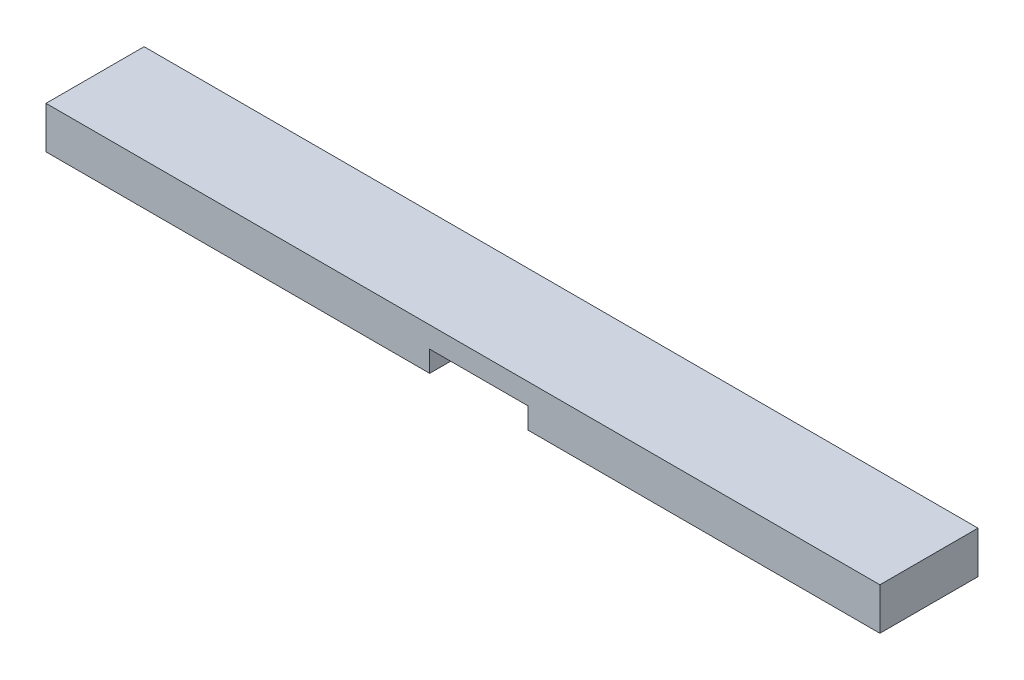
ISO-10303-21;
HEADER;
FILE_DESCRIPTION(('STEP AP214'),'2;1');
FILE_NAME('part.step','',(''),(''),'','','');
FILE_SCHEMA(('AUTOMOTIVE_DESIGN { 1 0 10303 214 1 1 1 1 }'));
ENDSEC;
DATA;
#1=APPLICATION_CONTEXT('core data for automotive mechanical design processes');
#2=APPLICATION_PROTOCOL_DEFINITION('international standard','automotive_design',2000,#1);
#3=PRODUCT_CONTEXT('',#1,'mechanical');
#4=PRODUCT('Part','Part','',(#3));
#5=PRODUCT_RELATED_PRODUCT_CATEGORY('part','',(#4));
#6=PRODUCT_DEFINITION_FORMATION('','',#4);
#7=PRODUCT_DEFINITION_CONTEXT('part definition',#1,'design');
#8=PRODUCT_DEFINITION('design','',#6,#7);
#9=PRODUCT_DEFINITION_SHAPE('','',#8);
#10=(LENGTH_UNIT() NAMED_UNIT(*) SI_UNIT(.MILLI.,.METRE.));
#11=(NAMED_UNIT(*) PLANE_ANGLE_UNIT() SI_UNIT($,.RADIAN.));
#12=(NAMED_UNIT(*) SI_UNIT($,.STERADIAN.) SOLID_ANGLE_UNIT());
#13=UNCERTAINTY_MEASURE_WITH_UNIT(LENGTH_MEASURE(1.E-05),#10,'distance_accuracy_value','');
#14=(GEOMETRIC_REPRESENTATION_CONTEXT(3) GLOBAL_UNCERTAINTY_ASSIGNED_CONTEXT((#13)) GLOBAL_UNIT_ASSIGNED_CONTEXT((#10,
#11,#12)) REPRESENTATION_CONTEXT('',''));
#15=CARTESIAN_POINT('',(0.,0.,0.));
#16=DIRECTION('',(0.,0.,1.));
#17=DIRECTION('',(1.,0.,0.));
#18=AXIS2_PLACEMENT_3D('',#15,#16,#17);
#19=CARTESIAN_POINT('',(0.,0.,0.));
#20=DIRECTION('',(0.,-1.,0.));
#21=DIRECTION('',(0.,0.,-1.));
#22=AXIS2_PLACEMENT_3D('',#19,#20,#21);
#23=PLANE('',#22);
#24=DIRECTION('',(0.,0.,-1.));
#25=VECTOR('',#24,1.);
#26=CARTESIAN_POINT('',(347.6752,0.,0.));
#27=LINE('',#26,#25);
#28=CARTESIAN_POINT('',(347.6752,0.,0.));
#29=VERTEX_POINT('',#28);
#30=CARTESIAN_POINT('',(347.6752,0.,-88.9));
#31=VERTEX_POINT('',#30);
#32=EDGE_CURVE('E117',#29,#31,#27,.T.);
#33=ORIENTED_EDGE('',*,*,#32,.F.);
#34=DIRECTION('',(1.,0.,0.));
#35=VECTOR('',#34,1.);
#36=CARTESIAN_POINT('',(0.,0.,0.));
#37=LINE('',#36,#35);
#38=CARTESIAN_POINT('',(0.,0.,0.));
#39=VERTEX_POINT('',#38);
#40=EDGE_CURVE('E157',#39,#29,#37,.T.);
#41=ORIENTED_EDGE('',*,*,#40,.F.);
#42=DIRECTION('',(0.,0.,1.));
#43=VECTOR('',#42,1.);
#44=CARTESIAN_POINT('',(0.,0.,0.));
#45=LINE('',#44,#43);
#46=CARTESIAN_POINT('',(0.,0.,-88.9));
#47=VERTEX_POINT('',#46);
#48=EDGE_CURVE('E141',#47,#39,#45,.T.);
#49=ORIENTED_EDGE('',*,*,#48,.F.);
#50=DIRECTION('',(-1.,0.,0.));
#51=VECTOR('',#50,1.);
#52=CARTESIAN_POINT('',(0.,0.,-88.9));
#53=LINE('',#52,#51);
#54=EDGE_CURVE('E84',#31,#47,#53,.T.);
#55=ORIENTED_EDGE('',*,*,#54,.F.);
#56=EDGE_LOOP('',(#33,#41,#49,#55));
#57=FACE_BOUND('',#56,.T.);
#58=ADVANCED_FACE('F39',(#57),#23,.T.);
#59=CARTESIAN_POINT('',(0.,38.1,0.));
#60=DIRECTION('',(1.,0.,0.));
#61=DIRECTION('',(0.,0.,-1.));
#62=AXIS2_PLACEMENT_3D('',#59,#60,#61);
#63=PLANE('',#62);
#64=ORIENTED_EDGE('',*,*,#48,.T.);
#65=DIRECTION('',(0.,-1.,0.));
#66=VECTOR('',#65,1.);
#67=CARTESIAN_POINT('',(0.,38.1,0.));
#68=LINE('',#67,#66);
#69=CARTESIAN_POINT('',(0.,38.1,0.));
#70=VERTEX_POINT('',#69);
#71=EDGE_CURVE('E11',#70,#39,#68,.T.);
#72=ORIENTED_EDGE('',*,*,#71,.F.);
#73=DIRECTION('',(0.,0.,1.));
#74=VECTOR('',#73,1.);
#75=CARTESIAN_POINT('',(0.,38.1,0.));
#76=LINE('',#75,#74);
#77=CARTESIAN_POINT('',(0.,38.1,-88.9));
#78=VERTEX_POINT('',#77);
#79=EDGE_CURVE('E146',#78,#70,#76,.T.);
#80=ORIENTED_EDGE('',*,*,#79,.F.);
#81=DIRECTION('',(0.,-1.,0.));
#82=VECTOR('',#81,1.);
#83=CARTESIAN_POINT('',(0.,38.1,-88.9));
#84=LINE('',#83,#82);
#85=EDGE_CURVE('E153',#78,#47,#84,.T.);
#86=ORIENTED_EDGE('',*,*,#85,.T.);
#87=EDGE_LOOP('',(#64,#72,#80,#86));
#88=FACE_BOUND('',#87,.T.);
#89=ADVANCED_FACE('F41',(#88),#63,.F.);
#90=CARTESIAN_POINT('',(0.,38.1,0.));
#91=DIRECTION('',(0.,0.,-1.));
#92=DIRECTION('',(-1.,0.,0.));
#93=AXIS2_PLACEMENT_3D('',#90,#91,#92);
#94=PLANE('',#93);
#95=ORIENTED_EDGE('',*,*,#40,.T.);
#96=DIRECTION('',(0.,-1.,0.));
#97=VECTOR('',#96,1.);
#98=CARTESIAN_POINT('',(347.6752,19.05,0.));
#99=LINE('',#98,#97);
#100=CARTESIAN_POINT('',(347.6752,19.05,0.));
#101=VERTEX_POINT('',#100);
#102=EDGE_CURVE('E139',#101,#29,#99,.T.);
#103=ORIENTED_EDGE('',*,*,#102,.F.);
#104=DIRECTION('',(-1.,0.,0.));
#105=VECTOR('',#104,1.);
#106=CARTESIAN_POINT('',(347.6752,19.05,0.));
#107=LINE('',#106,#105);
#108=CARTESIAN_POINT('',(436.5752,19.05,0.));
#109=VERTEX_POINT('',#108);
#110=EDGE_CURVE('E119',#109,#101,#107,.T.);
#111=ORIENTED_EDGE('',*,*,#110,.F.);
#112=DIRECTION('',(0.,-1.,0.));
#113=VECTOR('',#112,1.);
#114=CARTESIAN_POINT('',(436.5752,19.05,0.));
#115=LINE('',#114,#113);
#116=CARTESIAN_POINT('',(436.5752,0.,0.));
#117=VERTEX_POINT('',#116);
#118=EDGE_CURVE('E142',#109,#117,#115,.T.);
#119=ORIENTED_EDGE('',*,*,#118,.T.);
#120=CARTESIAN_POINT('',(755.65,0.,0.));
#121=VERTEX_POINT('',#120);
#122=EDGE_CURVE('E156',#117,#121,#37,.T.);
#123=ORIENTED_EDGE('',*,*,#122,.T.);
#124=DIRECTION('',(0.,-1.,0.));
#125=VECTOR('',#124,1.);
#126=CARTESIAN_POINT('',(755.65,38.1,0.));
#127=LINE('',#126,#125);
#128=CARTESIAN_POINT('',(755.65,38.1,0.));
#129=VERTEX_POINT('',#128);
#130=EDGE_CURVE('E47',#129,#121,#127,.T.);
#131=ORIENTED_EDGE('',*,*,#130,.F.);
#132=DIRECTION('',(1.,0.,0.));
#133=VECTOR('',#132,1.);
#134=CARTESIAN_POINT('',(0.,38.1,0.));
#135=LINE('',#134,#133);
#136=EDGE_CURVE('E91',#70,#129,#135,.T.);
#137=ORIENTED_EDGE('',*,*,#136,.F.);
#138=ORIENTED_EDGE('',*,*,#71,.T.);
#139=EDGE_LOOP('',(#95,#103,#111,#119,#123,#131,#137,#138));
#140=FACE_BOUND('',#139,.T.);
#141=ADVANCED_FACE('F197',(#140),#94,.F.);
#142=CARTESIAN_POINT('',(755.65,38.1,0.));
#143=DIRECTION('',(-1.,0.,0.));
#144=DIRECTION('',(0.,0.,1.));
#145=AXIS2_PLACEMENT_3D('',#142,#143,#144);
#146=PLANE('',#145);
#147=DIRECTION('',(0.,0.,-1.));
#148=VECTOR('',#147,1.);
#149=CARTESIAN_POINT('',(755.65,0.,0.));
#150=LINE('',#149,#148);
#151=CARTESIAN_POINT('',(755.65,0.,-88.9));
#152=VERTEX_POINT('',#151);
#153=EDGE_CURVE('E160',#121,#152,#150,.T.);
#154=ORIENTED_EDGE('',*,*,#153,.T.);
#155=DIRECTION('',(0.,-1.,0.));
#156=VECTOR('',#155,1.);
#157=CARTESIAN_POINT('',(755.65,38.1,-88.9));
#158=LINE('',#157,#156);
#159=CARTESIAN_POINT('',(755.65,38.1,-88.9));
#160=VERTEX_POINT('',#159);
#161=EDGE_CURVE('E164',#160,#152,#158,.T.);
#162=ORIENTED_EDGE('',*,*,#161,.F.);
#163=DIRECTION('',(0.,0.,-1.));
#164=VECTOR('',#163,1.);
#165=CARTESIAN_POINT('',(755.65,38.1,0.));
#166=LINE('',#165,#164);
#167=EDGE_CURVE('E150',#129,#160,#166,.T.);
#168=ORIENTED_EDGE('',*,*,#167,.F.);
#169=ORIENTED_EDGE('',*,*,#130,.T.);
#170=EDGE_LOOP('',(#154,#162,#168,#169));
#171=FACE_BOUND('',#170,.T.);
#172=ADVANCED_FACE('F170',(#171),#146,.F.);
#173=CARTESIAN_POINT('',(0.,38.1,-88.9));
#174=DIRECTION('',(0.,0.,1.));
#175=DIRECTION('',(1.,0.,0.));
#176=AXIS2_PLACEMENT_3D('',#173,#174,#175);
#177=PLANE('',#176);
#178=DIRECTION('',(1.,0.,0.));
#179=VECTOR('',#178,1.);
#180=CARTESIAN_POINT('',(347.6752,19.05,-88.9));
#181=LINE('',#180,#179);
#182=CARTESIAN_POINT('',(347.6752,19.05,-88.9));
#183=VERTEX_POINT('',#182);
#184=CARTESIAN_POINT('',(436.5752,19.05,-88.9));
#185=VERTEX_POINT('',#184);
#186=EDGE_CURVE('E125',#183,#185,#181,.T.);
#187=ORIENTED_EDGE('',*,*,#186,.F.);
#188=DIRECTION('',(0.,-1.,0.));
#189=VECTOR('',#188,1.);
#190=CARTESIAN_POINT('',(347.6752,19.05,-88.9));
#191=LINE('',#190,#189);
#192=EDGE_CURVE('E111',#183,#31,#191,.T.);
#193=ORIENTED_EDGE('',*,*,#192,.T.);
#194=ORIENTED_EDGE('',*,*,#54,.T.);
#195=ORIENTED_EDGE('',*,*,#85,.F.);
#196=DIRECTION('',(-1.,0.,0.));
#197=VECTOR('',#196,1.);
#198=CARTESIAN_POINT('',(0.,38.1,-88.9));
#199=LINE('',#198,#197);
#200=EDGE_CURVE('E63',#160,#78,#199,.T.);
#201=ORIENTED_EDGE('',*,*,#200,.F.);
#202=ORIENTED_EDGE('',*,*,#161,.T.);
#203=CARTESIAN_POINT('',(436.5752,0.,-88.9));
#204=VERTEX_POINT('',#203);
#205=EDGE_CURVE('E148',#152,#204,#53,.T.);
#206=ORIENTED_EDGE('',*,*,#205,.T.);
#207=DIRECTION('',(0.,-1.,0.));
#208=VECTOR('',#207,1.);
#209=CARTESIAN_POINT('',(436.5752,19.05,-88.9));
#210=LINE('',#209,#208);
#211=EDGE_CURVE('E54',#185,#204,#210,.T.);
#212=ORIENTED_EDGE('',*,*,#211,.F.);
#213=EDGE_LOOP('',(#187,#193,#194,#195,#201,#202,#206,#212));
#214=FACE_BOUND('',#213,.T.);
#215=ADVANCED_FACE('F130',(#214),#177,.F.);
#216=CARTESIAN_POINT('',(0.,38.1,0.));
#217=DIRECTION('',(0.,-1.,0.));
#218=DIRECTION('',(0.,0.,-1.));
#219=AXIS2_PLACEMENT_3D('',#216,#217,#218);
#220=PLANE('',#219);
#221=ORIENTED_EDGE('',*,*,#79,.T.);
#222=ORIENTED_EDGE('',*,*,#136,.T.);
#223=ORIENTED_EDGE('',*,*,#167,.T.);
#224=ORIENTED_EDGE('',*,*,#200,.T.);
#225=EDGE_LOOP('',(#221,#222,#223,#224));
#226=FACE_BOUND('',#225,.T.);
#227=ADVANCED_FACE('F180',(#226),#220,.F.);
#228=DIRECTION('',(0.,0.,1.));
#229=VECTOR('',#228,1.);
#230=CARTESIAN_POINT('',(436.5752,0.,0.));
#231=LINE('',#230,#229);
#232=EDGE_CURVE('E128',#204,#117,#231,.T.);
#233=ORIENTED_EDGE('',*,*,#232,.F.);
#234=ORIENTED_EDGE('',*,*,#205,.F.);
#235=ORIENTED_EDGE('',*,*,#153,.F.);
#236=ORIENTED_EDGE('',*,*,#122,.F.);
#237=EDGE_LOOP('',(#233,#234,#235,#236));
#238=FACE_BOUND('',#237,.T.);
#239=ADVANCED_FACE('F175',(#238),#23,.T.);
#240=CARTESIAN_POINT('',(347.6752,19.05,0.));
#241=DIRECTION('',(-1.,0.,0.));
#242=DIRECTION('',(0.,0.,1.));
#243=AXIS2_PLACEMENT_3D('',#240,#241,#242);
#244=PLANE('',#243);
#245=ORIENTED_EDGE('',*,*,#32,.T.);
#246=ORIENTED_EDGE('',*,*,#192,.F.);
#247=DIRECTION('',(0.,0.,-1.));
#248=VECTOR('',#247,1.);
#249=CARTESIAN_POINT('',(347.6752,19.05,0.));
#250=LINE('',#249,#248);
#251=EDGE_CURVE('E114',#101,#183,#250,.T.);
#252=ORIENTED_EDGE('',*,*,#251,.F.);
#253=ORIENTED_EDGE('',*,*,#102,.T.);
#254=EDGE_LOOP('',(#245,#246,#252,#253));
#255=FACE_BOUND('',#254,.T.);
#256=ADVANCED_FACE('F113',(#255),#244,.F.);
#257=CARTESIAN_POINT('',(436.5752,19.05,0.));
#258=DIRECTION('',(1.,0.,0.));
#259=DIRECTION('',(0.,0.,-1.));
#260=AXIS2_PLACEMENT_3D('',#257,#258,#259);
#261=PLANE('',#260);
#262=ORIENTED_EDGE('',*,*,#232,.T.);
#263=ORIENTED_EDGE('',*,*,#118,.F.);
#264=DIRECTION('',(0.,0.,1.));
#265=VECTOR('',#264,1.);
#266=CARTESIAN_POINT('',(436.5752,19.05,0.));
#267=LINE('',#266,#265);
#268=EDGE_CURVE('E132',#185,#109,#267,.T.);
#269=ORIENTED_EDGE('',*,*,#268,.F.);
#270=ORIENTED_EDGE('',*,*,#211,.T.);
#271=EDGE_LOOP('',(#262,#263,#269,#270));
#272=FACE_BOUND('',#271,.T.);
#273=ADVANCED_FACE('F201',(#272),#261,.F.);
#274=CARTESIAN_POINT('',(0.,19.05,0.));
#275=DIRECTION('',(0.,-1.,0.));
#276=DIRECTION('',(0.,0.,-1.));
#277=AXIS2_PLACEMENT_3D('',#274,#275,#276);
#278=PLANE('',#277);
#279=ORIENTED_EDGE('',*,*,#251,.T.);
#280=ORIENTED_EDGE('',*,*,#186,.T.);
#281=ORIENTED_EDGE('',*,*,#268,.T.);
#282=ORIENTED_EDGE('',*,*,#110,.T.);
#283=EDGE_LOOP('',(#279,#280,#281,#282));
#284=FACE_BOUND('',#283,.T.);
#285=ADVANCED_FACE('F123',(#284),#278,.T.);
#286=CLOSED_SHELL('',(#58,#89,#141,#172,#215,#227,#239,#256,#273,#285));
#287=MANIFOLD_SOLID_BREP('B2',#286);
#288=ADVANCED_BREP_SHAPE_REPRESENTATION('',(#18,#287),#14);
#289=SHAPE_DEFINITION_REPRESENTATION(#9,#288);
ENDSEC;
END-ISO-10303-21;
